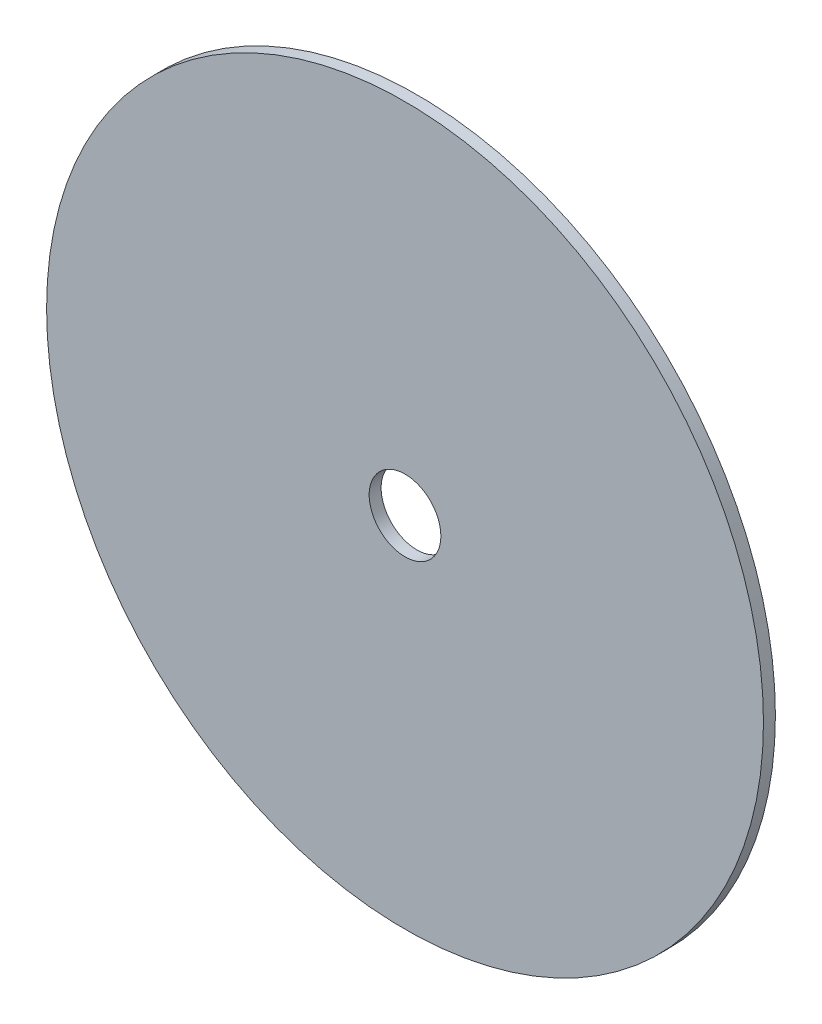
ISO-10303-21;
HEADER;
FILE_DESCRIPTION(('STEP AP214'),'2;1');
FILE_NAME('part.step','',(''),(''),'','','');
FILE_SCHEMA(('AUTOMOTIVE_DESIGN { 1 0 10303 214 1 1 1 1 }'));
ENDSEC;
DATA;
#1=APPLICATION_CONTEXT('core data for automotive mechanical design processes');
#2=APPLICATION_PROTOCOL_DEFINITION('international standard','automotive_design',2000,#1);
#3=PRODUCT_CONTEXT('',#1,'mechanical');
#4=PRODUCT('Part','Part','',(#3));
#5=PRODUCT_RELATED_PRODUCT_CATEGORY('part','',(#4));
#6=PRODUCT_DEFINITION_FORMATION('','',#4);
#7=PRODUCT_DEFINITION_CONTEXT('part definition',#1,'design');
#8=PRODUCT_DEFINITION('design','',#6,#7);
#9=PRODUCT_DEFINITION_SHAPE('','',#8);
#10=(LENGTH_UNIT() NAMED_UNIT(*) SI_UNIT(.MILLI.,.METRE.));
#11=(NAMED_UNIT(*) PLANE_ANGLE_UNIT() SI_UNIT($,.RADIAN.));
#12=(NAMED_UNIT(*) SI_UNIT($,.STERADIAN.) SOLID_ANGLE_UNIT());
#13=UNCERTAINTY_MEASURE_WITH_UNIT(LENGTH_MEASURE(1.E-05),#10,'distance_accuracy_value','');
#14=(GEOMETRIC_REPRESENTATION_CONTEXT(3) GLOBAL_UNCERTAINTY_ASSIGNED_CONTEXT((#13)) GLOBAL_UNIT_ASSIGNED_CONTEXT((#10,
#11,#12)) REPRESENTATION_CONTEXT('',''));
#15=CARTESIAN_POINT('',(0.,0.,0.));
#16=DIRECTION('',(0.,0.,1.));
#17=DIRECTION('',(1.,0.,0.));
#18=AXIS2_PLACEMENT_3D('',#15,#16,#17);
#19=CARTESIAN_POINT('',(8.73109362586888E-08,-3.88578058618805E-13,5.00000000465713));
#20=DIRECTION('',(0.,0.,0.999999999999982));
#21=DIRECTION('',(1.00000000000005,0.,0.));
#22=AXIS2_PLACEMENT_3D('',#19,#20,#21);
#23=PLANE('',#22);
#24=CARTESIAN_POINT('',(8.73109362586888E-08,-3.88578058618805E-13,5.00000000465713));
#25=DIRECTION('',(0.,0.,0.999999999999982));
#26=DIRECTION('',(1.00000000000005,0.,0.));
#27=AXIS2_PLACEMENT_3D('',#24,#25,#26);
#28=CIRCLE('',#27,150.);
#29=CARTESIAN_POINT('',(150.000000087319,3.11070613712161E-12,5.00000000465751));
#30=VERTEX_POINT('',#29);
#31=EDGE_CURVE('E10',#30,#30,#28,.T.);
#32=ORIENTED_EDGE('',*,*,#31,.T.);
#33=EDGE_LOOP('',(#32));
#34=FACE_BOUND('',#33,.T.);
#35=CARTESIAN_POINT('',(8.73109362586888E-08,-3.88578058618805E-13,5.00000000465713));
#36=DIRECTION('',(0.,0.,0.999999999999982));
#37=DIRECTION('',(1.00000000000005,0.,0.));
#38=AXIS2_PLACEMENT_3D('',#35,#36,#37);
#39=CIRCLE('',#38,15.);
#40=CARTESIAN_POINT('',(15.0000000873117,0.,5.00000000465716));
#41=VERTEX_POINT('',#40);
#42=EDGE_CURVE('E45',#41,#41,#39,.T.);
#43=ORIENTED_EDGE('',*,*,#42,.F.);
#44=EDGE_LOOP('',(#43));
#45=FACE_BOUND('',#44,.T.);
#46=ADVANCED_FACE('F34',(#34,#45),#23,.T.);
#47=CARTESIAN_POINT('',(0.,0.,0.));
#48=DIRECTION('',(0.,0.,0.999999999999982));
#49=DIRECTION('',(1.00000000000005,0.,0.));
#50=AXIS2_PLACEMENT_3D('',#47,#48,#49);
#51=PLANE('',#50);
#52=CARTESIAN_POINT('',(0.,0.,0.));
#53=DIRECTION('',(0.,0.,0.999999999999982));
#54=DIRECTION('',(1.00000000000005,0.,0.));
#55=AXIS2_PLACEMENT_3D('',#52,#53,#54);
#56=CIRCLE('',#55,150.);
#57=CARTESIAN_POINT('',(150.000000000008,3.49928419574041E-12,3.78863607153335E-13));
#58=VERTEX_POINT('',#57);
#59=EDGE_CURVE('E38',#58,#58,#56,.T.);
#60=ORIENTED_EDGE('',*,*,#59,.F.);
#61=EDGE_LOOP('',(#60));
#62=FACE_BOUND('',#61,.T.);
#63=CARTESIAN_POINT('',(0.,0.,0.));
#64=DIRECTION('',(0.,0.,0.999999999999982));
#65=DIRECTION('',(1.00000000000005,0.,0.));
#66=AXIS2_PLACEMENT_3D('',#63,#64,#65);
#67=CIRCLE('',#66,15.);
#68=CARTESIAN_POINT('',(15.0000000000008,3.49928419574042E-13,0.));
#69=VERTEX_POINT('',#68);
#70=EDGE_CURVE('E47',#69,#69,#67,.T.);
#71=ORIENTED_EDGE('',*,*,#70,.T.);
#72=EDGE_LOOP('',(#71));
#73=FACE_BOUND('',#72,.T.);
#74=ADVANCED_FACE('F57',(#62,#73),#51,.F.);
#75=CARTESIAN_POINT('',(8.73109362586888E-08,-3.88578058618805E-13,5.00000000465713));
#76=DIRECTION('',(0.,0.,-0.999999999999982));
#77=DIRECTION('',(-1.00000000000005,0.,0.));
#78=AXIS2_PLACEMENT_3D('',#75,#76,#77);
#79=CYLINDRICAL_SURFACE('',#78,150.);
#80=ORIENTED_EDGE('',*,*,#31,.F.);
#81=EDGE_LOOP('',(#80));
#82=FACE_BOUND('',#81,.T.);
#83=ORIENTED_EDGE('',*,*,#59,.T.);
#84=EDGE_LOOP('',(#83));
#85=FACE_BOUND('',#84,.T.);
#86=ADVANCED_FACE('F36',(#82,#85),#79,.T.);
#87=CARTESIAN_POINT('',(8.73109362586888E-08,-3.88578058618805E-13,5.00000000465713));
#88=DIRECTION('',(0.,0.,-0.999999999999982));
#89=DIRECTION('',(-1.00000000000005,0.,0.));
#90=AXIS2_PLACEMENT_3D('',#87,#88,#89);
#91=CYLINDRICAL_SURFACE('',#90,15.);
#92=ORIENTED_EDGE('',*,*,#42,.T.);
#93=EDGE_LOOP('',(#92));
#94=FACE_BOUND('',#93,.T.);
#95=ORIENTED_EDGE('',*,*,#70,.F.);
#96=EDGE_LOOP('',(#95));
#97=FACE_BOUND('',#96,.T.);
#98=ADVANCED_FACE('F53',(#94,#97),#91,.F.);
#99=CLOSED_SHELL('',(#46,#74,#86,#98));
#100=MANIFOLD_SOLID_BREP('B2',#99);
#101=ADVANCED_BREP_SHAPE_REPRESENTATION('',(#18,#100),#14);
#102=SHAPE_DEFINITION_REPRESENTATION(#9,#101);
ENDSEC;
END-ISO-10303-21;
